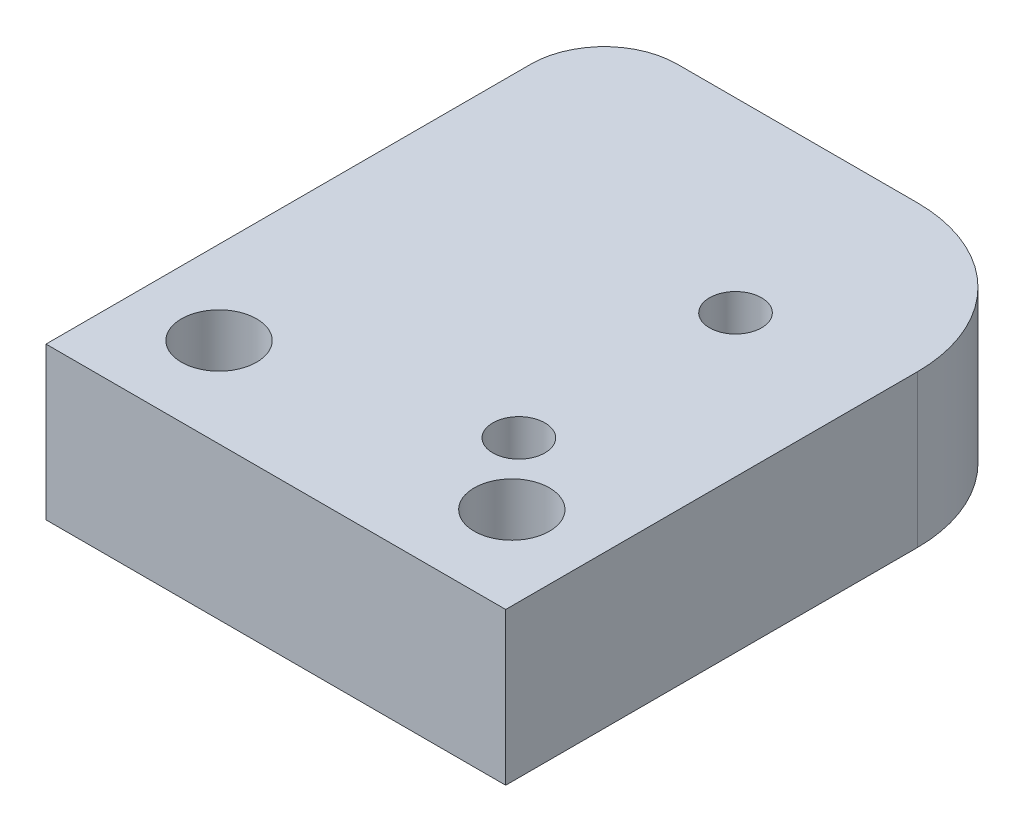
ISO-10303-21;
HEADER;
FILE_DESCRIPTION(('STEP AP214'),'2;1');
FILE_NAME('part.step','',(''),(''),'','','');
FILE_SCHEMA(('AUTOMOTIVE_DESIGN { 1 0 10303 214 1 1 1 1 }'));
ENDSEC;
DATA;
#1=APPLICATION_CONTEXT('core data for automotive mechanical design processes');
#2=APPLICATION_PROTOCOL_DEFINITION('international standard','automotive_design',2000,#1);
#3=PRODUCT_CONTEXT('',#1,'mechanical');
#4=PRODUCT('Part','Part','',(#3));
#5=PRODUCT_RELATED_PRODUCT_CATEGORY('part','',(#4));
#6=PRODUCT_DEFINITION_FORMATION('','',#4);
#7=PRODUCT_DEFINITION_CONTEXT('part definition',#1,'design');
#8=PRODUCT_DEFINITION('design','',#6,#7);
#9=PRODUCT_DEFINITION_SHAPE('','',#8);
#10=(LENGTH_UNIT() NAMED_UNIT(*) SI_UNIT(.MILLI.,.METRE.));
#11=(NAMED_UNIT(*) PLANE_ANGLE_UNIT() SI_UNIT($,.RADIAN.));
#12=(NAMED_UNIT(*) SI_UNIT($,.STERADIAN.) SOLID_ANGLE_UNIT());
#13=UNCERTAINTY_MEASURE_WITH_UNIT(LENGTH_MEASURE(1.E-05),#10,'distance_accuracy_value','');
#14=(GEOMETRIC_REPRESENTATION_CONTEXT(3) GLOBAL_UNCERTAINTY_ASSIGNED_CONTEXT((#13)) GLOBAL_UNIT_ASSIGNED_CONTEXT((#10,
#11,#12)) REPRESENTATION_CONTEXT('',''));
#15=CARTESIAN_POINT('',(0.,0.,0.));
#16=DIRECTION('',(0.,0.,1.));
#17=DIRECTION('',(1.,0.,0.));
#18=AXIS2_PLACEMENT_3D('',#15,#16,#17);
#19=CARTESIAN_POINT('',(-9.9695,6.604,-24.2062));
#20=DIRECTION('',(1.,0.,0.));
#21=DIRECTION('',(0.,0.,-1.));
#22=AXIS2_PLACEMENT_3D('',#19,#20,#21);
#23=PLANE('',#22);
#24=DIRECTION('',(0.,0.,1.));
#25=VECTOR('',#24,1.);
#26=CARTESIAN_POINT('',(-9.9695,6.604,-24.2062));
#27=LINE('',#26,#25);
#28=CARTESIAN_POINT('',(-9.9695,6.604,-21.0312));
#29=VERTEX_POINT('',#28);
#30=CARTESIAN_POINT('',(-9.96950000000001,6.604,0.));
#31=VERTEX_POINT('',#30);
#32=EDGE_CURVE('E87',#29,#31,#27,.T.);
#33=ORIENTED_EDGE('',*,*,#32,.F.);
#34=DIRECTION('',(0.,-1.,0.));
#35=VECTOR('',#34,1.);
#36=CARTESIAN_POINT('',(-9.9695,6.604,-21.0312));
#37=LINE('',#36,#35);
#38=CARTESIAN_POINT('',(-9.9695,0.,-21.0312));
#39=VERTEX_POINT('',#38);
#40=EDGE_CURVE('E125',#29,#39,#37,.T.);
#41=ORIENTED_EDGE('',*,*,#40,.T.);
#42=DIRECTION('',(0.,0.,1.));
#43=VECTOR('',#42,1.);
#44=CARTESIAN_POINT('',(-9.9695,0.,-24.2062));
#45=LINE('',#44,#43);
#46=CARTESIAN_POINT('',(-9.96950000000001,0.,0.));
#47=VERTEX_POINT('',#46);
#48=EDGE_CURVE('E109',#39,#47,#45,.T.);
#49=ORIENTED_EDGE('',*,*,#48,.T.);
#50=DIRECTION('',(0.,-1.,0.));
#51=VECTOR('',#50,1.);
#52=CARTESIAN_POINT('',(-9.96950000000001,6.604,0.));
#53=LINE('',#52,#51);
#54=EDGE_CURVE('E103',#31,#47,#53,.T.);
#55=ORIENTED_EDGE('',*,*,#54,.F.);
#56=EDGE_LOOP('',(#33,#41,#49,#55));
#57=FACE_BOUND('',#56,.T.);
#58=ADVANCED_FACE('F35',(#57),#23,.F.);
#59=CARTESIAN_POINT('',(-9.96950000000001,6.604,0.));
#60=DIRECTION('',(0.,0.,-1.));
#61=DIRECTION('',(-1.,0.,0.));
#62=AXIS2_PLACEMENT_3D('',#59,#60,#61);
#63=PLANE('',#62);
#64=DIRECTION('',(1.,0.,0.));
#65=VECTOR('',#64,1.);
#66=CARTESIAN_POINT('',(-9.96950000000001,0.,0.));
#67=LINE('',#66,#65);
#68=CARTESIAN_POINT('',(9.96950000000001,0.,0.));
#69=VERTEX_POINT('',#68);
#70=EDGE_CURVE('E130',#47,#69,#67,.T.);
#71=ORIENTED_EDGE('',*,*,#70,.T.);
#72=DIRECTION('',(0.,-1.,0.));
#73=VECTOR('',#72,1.);
#74=CARTESIAN_POINT('',(9.96950000000001,6.604,0.));
#75=LINE('',#74,#73);
#76=CARTESIAN_POINT('',(9.96950000000001,6.604,0.));
#77=VERTEX_POINT('',#76);
#78=EDGE_CURVE('E105',#77,#69,#75,.T.);
#79=ORIENTED_EDGE('',*,*,#78,.F.);
#80=DIRECTION('',(1.,0.,0.));
#81=VECTOR('',#80,1.);
#82=CARTESIAN_POINT('',(-9.96950000000001,6.604,0.));
#83=LINE('',#82,#81);
#84=EDGE_CURVE('E91',#31,#77,#83,.T.);
#85=ORIENTED_EDGE('',*,*,#84,.F.);
#86=ORIENTED_EDGE('',*,*,#54,.T.);
#87=EDGE_LOOP('',(#71,#79,#85,#86));
#88=FACE_BOUND('',#87,.T.);
#89=ADVANCED_FACE('F102',(#88),#63,.F.);
#90=CARTESIAN_POINT('',(9.9695,6.604,-24.2062));
#91=DIRECTION('',(-1.,0.,0.));
#92=DIRECTION('',(0.,0.,1.));
#93=AXIS2_PLACEMENT_3D('',#90,#91,#92);
#94=PLANE('',#93);
#95=DIRECTION('',(0.,0.,-1.));
#96=VECTOR('',#95,1.);
#97=CARTESIAN_POINT('',(9.9695,0.,-24.2062));
#98=LINE('',#97,#96);
#99=CARTESIAN_POINT('',(9.9695,0.,-17.8562));
#100=VERTEX_POINT('',#99);
#101=EDGE_CURVE('E133',#69,#100,#98,.T.);
#102=ORIENTED_EDGE('',*,*,#101,.T.);
#103=DIRECTION('',(0.,-1.,0.));
#104=VECTOR('',#103,1.);
#105=CARTESIAN_POINT('',(9.9695,6.604,-17.8562));
#106=LINE('',#105,#104);
#107=CARTESIAN_POINT('',(9.9695,6.604,-17.8562));
#108=VERTEX_POINT('',#107);
#109=EDGE_CURVE('E121',#100,#108,#106,.F.);
#110=ORIENTED_EDGE('',*,*,#109,.T.);
#111=DIRECTION('',(0.,0.,-1.));
#112=VECTOR('',#111,1.);
#113=CARTESIAN_POINT('',(9.9695,6.604,-24.2062));
#114=LINE('',#113,#112);
#115=EDGE_CURVE('E107',#77,#108,#114,.T.);
#116=ORIENTED_EDGE('',*,*,#115,.F.);
#117=ORIENTED_EDGE('',*,*,#78,.T.);
#118=EDGE_LOOP('',(#102,#110,#116,#117));
#119=FACE_BOUND('',#118,.T.);
#120=ADVANCED_FACE('F156',(#119),#94,.F.);
#121=CARTESIAN_POINT('',(-9.9695,6.604,-24.2062));
#122=DIRECTION('',(0.,0.,1.));
#123=DIRECTION('',(1.,0.,0.));
#124=AXIS2_PLACEMENT_3D('',#121,#122,#123);
#125=PLANE('',#124);
#126=DIRECTION('',(-1.,0.,0.));
#127=VECTOR('',#126,1.);
#128=CARTESIAN_POINT('',(-9.9695,0.,-24.2062));
#129=LINE('',#128,#127);
#130=CARTESIAN_POINT('',(3.61950000000001,0.,-24.2062));
#131=VERTEX_POINT('',#130);
#132=CARTESIAN_POINT('',(-6.7945,0.,-24.2062));
#133=VERTEX_POINT('',#132);
#134=EDGE_CURVE('E98',#131,#133,#129,.T.);
#135=ORIENTED_EDGE('',*,*,#134,.T.);
#136=DIRECTION('',(0.,-1.,0.));
#137=VECTOR('',#136,1.);
#138=CARTESIAN_POINT('',(-6.7945,6.604,-24.2062));
#139=LINE('',#138,#137);
#140=CARTESIAN_POINT('',(-6.7945,6.604,-24.2062));
#141=VERTEX_POINT('',#140);
#142=EDGE_CURVE('E43',#133,#141,#139,.F.);
#143=ORIENTED_EDGE('',*,*,#142,.T.);
#144=DIRECTION('',(-1.,0.,0.));
#145=VECTOR('',#144,1.);
#146=CARTESIAN_POINT('',(-9.9695,6.604,-24.2062));
#147=LINE('',#146,#145);
#148=CARTESIAN_POINT('',(3.61950000000001,6.604,-24.2062));
#149=VERTEX_POINT('',#148);
#150=EDGE_CURVE('E116',#149,#141,#147,.T.);
#151=ORIENTED_EDGE('',*,*,#150,.F.);
#152=DIRECTION('',(0.,-1.,0.));
#153=VECTOR('',#152,1.);
#154=CARTESIAN_POINT('',(3.61950000000001,6.604,-24.2062));
#155=LINE('',#154,#153);
#156=EDGE_CURVE('E111',#149,#131,#155,.T.);
#157=ORIENTED_EDGE('',*,*,#156,.T.);
#158=EDGE_LOOP('',(#135,#143,#151,#157));
#159=FACE_BOUND('',#158,.T.);
#160=ADVANCED_FACE('F142',(#159),#125,.F.);
#161=CARTESIAN_POINT('',(0.,6.604,0.));
#162=DIRECTION('',(0.,1.,0.));
#163=DIRECTION('',(0.,0.,1.));
#164=AXIS2_PLACEMENT_3D('',#161,#162,#163);
#165=PLANE('',#164);
#166=CARTESIAN_POINT('',(-6.35,6.604,-3.8862));
#167=DIRECTION('',(0.,-1.,0.));
#168=DIRECTION('',(0.,0.,-1.));
#169=AXIS2_PLACEMENT_3D('',#166,#167,#168);
#170=CIRCLE('',#169,1.63195);
#171=CARTESIAN_POINT('',(-6.35,6.604,-5.51815));
#172=VERTEX_POINT('',#171);
#173=EDGE_CURVE('E215',#172,#172,#170,.T.);
#174=ORIENTED_EDGE('',*,*,#173,.T.);
#175=EDGE_LOOP('',(#174));
#176=FACE_BOUND('',#175,.T.);
#177=CARTESIAN_POINT('',(6.35,6.604,-3.8862));
#178=DIRECTION('',(0.,-1.,0.));
#179=DIRECTION('',(0.,0.,-1.));
#180=AXIS2_PLACEMENT_3D('',#177,#178,#179);
#181=CIRCLE('',#180,1.63195);
#182=CARTESIAN_POINT('',(6.35,6.604,-5.51815));
#183=VERTEX_POINT('',#182);
#184=EDGE_CURVE('E227',#183,#183,#181,.T.);
#185=ORIENTED_EDGE('',*,*,#184,.T.);
#186=EDGE_LOOP('',(#185));
#187=FACE_BOUND('',#186,.T.);
#188=CARTESIAN_POINT('',(3.81,6.604,-16.129));
#189=DIRECTION('',(0.,1.,0.));
#190=DIRECTION('',(0.,0.,1.));
#191=AXIS2_PLACEMENT_3D('',#188,#189,#190);
#192=CIRCLE('',#191,1.13029999999999);
#193=CARTESIAN_POINT('',(3.81,6.604,-14.9987));
#194=VERTEX_POINT('',#193);
#195=EDGE_CURVE('E230',#194,#194,#192,.T.);
#196=ORIENTED_EDGE('',*,*,#195,.F.);
#197=EDGE_LOOP('',(#196));
#198=FACE_BOUND('',#197,.T.);
#199=CARTESIAN_POINT('',(3.81,6.604,-6.731));
#200=DIRECTION('',(0.,1.,0.));
#201=DIRECTION('',(0.,0.,1.));
#202=AXIS2_PLACEMENT_3D('',#199,#200,#201);
#203=CIRCLE('',#202,1.13029999999999);
#204=CARTESIAN_POINT('',(3.81,6.604,-5.60070000000001));
#205=VERTEX_POINT('',#204);
#206=EDGE_CURVE('E136',#205,#205,#203,.T.);
#207=ORIENTED_EDGE('',*,*,#206,.F.);
#208=EDGE_LOOP('',(#207));
#209=FACE_BOUND('',#208,.T.);
#210=ORIENTED_EDGE('',*,*,#150,.T.);
#211=CARTESIAN_POINT('',(-6.7945,6.604,-21.0312));
#212=DIRECTION('',(0.,1.,0.));
#213=DIRECTION('',(0.,0.,1.));
#214=AXIS2_PLACEMENT_3D('',#211,#212,#213);
#215=CIRCLE('',#214,3.175);
#216=EDGE_CURVE('E11',#141,#29,#215,.T.);
#217=ORIENTED_EDGE('',*,*,#216,.T.);
#218=ORIENTED_EDGE('',*,*,#32,.T.);
#219=ORIENTED_EDGE('',*,*,#84,.T.);
#220=ORIENTED_EDGE('',*,*,#115,.T.);
#221=CARTESIAN_POINT('',(3.6195,6.604,-17.8562));
#222=DIRECTION('',(0.,1.,0.));
#223=DIRECTION('',(0.,0.,1.));
#224=AXIS2_PLACEMENT_3D('',#221,#222,#223);
#225=CIRCLE('',#224,6.35);
#226=EDGE_CURVE('E123',#108,#149,#225,.T.);
#227=ORIENTED_EDGE('',*,*,#226,.T.);
#228=EDGE_LOOP('',(#210,#217,#218,#219,#220,#227));
#229=FACE_BOUND('',#228,.T.);
#230=ADVANCED_FACE('F89',(#176,#187,#198,#209,#229),#165,.T.);
#231=CARTESIAN_POINT('',(0.,0.,0.));
#232=DIRECTION('',(0.,1.,0.));
#233=DIRECTION('',(0.,0.,1.));
#234=AXIS2_PLACEMENT_3D('',#231,#232,#233);
#235=PLANE('',#234);
#236=CARTESIAN_POINT('',(-6.35,0.,-3.8862));
#237=DIRECTION('',(0.,-1.,0.));
#238=DIRECTION('',(0.,0.,-1.));
#239=AXIS2_PLACEMENT_3D('',#236,#237,#238);
#240=CIRCLE('',#239,2.45109999999999);
#241=CARTESIAN_POINT('',(-6.35,0.,-6.33729999999999));
#242=VERTEX_POINT('',#241);
#243=EDGE_CURVE('E208',#242,#242,#240,.T.);
#244=ORIENTED_EDGE('',*,*,#243,.F.);
#245=EDGE_LOOP('',(#244));
#246=FACE_BOUND('',#245,.T.);
#247=CARTESIAN_POINT('',(6.35,0.,-3.8862));
#248=DIRECTION('',(0.,-1.,0.));
#249=DIRECTION('',(0.,0.,-1.));
#250=AXIS2_PLACEMENT_3D('',#247,#248,#249);
#251=CIRCLE('',#250,2.45109999999999);
#252=CARTESIAN_POINT('',(6.35,0.,-6.33729999999999));
#253=VERTEX_POINT('',#252);
#254=EDGE_CURVE('E218',#253,#253,#251,.T.);
#255=ORIENTED_EDGE('',*,*,#254,.F.);
#256=EDGE_LOOP('',(#255));
#257=FACE_BOUND('',#256,.T.);
#258=CARTESIAN_POINT('',(3.81,0.,-16.129));
#259=DIRECTION('',(0.,1.,0.));
#260=DIRECTION('',(0.,0.,1.));
#261=AXIS2_PLACEMENT_3D('',#258,#259,#260);
#262=CIRCLE('',#261,1.13029999999999);
#263=CARTESIAN_POINT('',(3.81,0.,-14.9987));
#264=VERTEX_POINT('',#263);
#265=EDGE_CURVE('E233',#264,#264,#262,.T.);
#266=ORIENTED_EDGE('',*,*,#265,.T.);
#267=EDGE_LOOP('',(#266));
#268=FACE_BOUND('',#267,.T.);
#269=CARTESIAN_POINT('',(3.81,0.,-6.731));
#270=DIRECTION('',(0.,1.,0.));
#271=DIRECTION('',(0.,0.,1.));
#272=AXIS2_PLACEMENT_3D('',#269,#270,#271);
#273=CIRCLE('',#272,1.13029999999999);
#274=CARTESIAN_POINT('',(3.81,0.,-5.60070000000001));
#275=VERTEX_POINT('',#274);
#276=EDGE_CURVE('E131',#275,#275,#273,.T.);
#277=ORIENTED_EDGE('',*,*,#276,.T.);
#278=EDGE_LOOP('',(#277));
#279=FACE_BOUND('',#278,.T.);
#280=ORIENTED_EDGE('',*,*,#48,.F.);
#281=CARTESIAN_POINT('',(-6.7945,0.,-21.0312));
#282=DIRECTION('',(0.,1.,0.));
#283=DIRECTION('',(0.,0.,1.));
#284=AXIS2_PLACEMENT_3D('',#281,#282,#283);
#285=CIRCLE('',#284,3.175);
#286=EDGE_CURVE('E57',#39,#133,#285,.F.);
#287=ORIENTED_EDGE('',*,*,#286,.T.);
#288=ORIENTED_EDGE('',*,*,#134,.F.);
#289=CARTESIAN_POINT('',(3.6195,0.,-17.8562));
#290=DIRECTION('',(0.,1.,0.));
#291=DIRECTION('',(0.,0.,1.));
#292=AXIS2_PLACEMENT_3D('',#289,#290,#291);
#293=CIRCLE('',#292,6.35);
#294=EDGE_CURVE('E114',#131,#100,#293,.F.);
#295=ORIENTED_EDGE('',*,*,#294,.T.);
#296=ORIENTED_EDGE('',*,*,#101,.F.);
#297=ORIENTED_EDGE('',*,*,#70,.F.);
#298=EDGE_LOOP('',(#280,#287,#288,#295,#296,#297));
#299=FACE_BOUND('',#298,.T.);
#300=ADVANCED_FACE('F128',(#246,#257,#268,#279,#299),#235,.F.);
#301=CARTESIAN_POINT('',(3.81,6.604,-6.731));
#302=DIRECTION('',(0.,1.,0.));
#303=DIRECTION('',(0.,0.,1.));
#304=AXIS2_PLACEMENT_3D('',#301,#302,#303);
#305=CYLINDRICAL_SURFACE('',#304,1.13029999999999);
#306=ORIENTED_EDGE('',*,*,#276,.F.);
#307=EDGE_LOOP('',(#306));
#308=FACE_BOUND('',#307,.T.);
#309=ORIENTED_EDGE('',*,*,#206,.T.);
#310=EDGE_LOOP('',(#309));
#311=FACE_BOUND('',#310,.T.);
#312=ADVANCED_FACE('F166',(#308,#311),#305,.F.);
#313=CARTESIAN_POINT('',(3.81,6.604,-16.129));
#314=DIRECTION('',(0.,1.,0.));
#315=DIRECTION('',(0.,0.,1.));
#316=AXIS2_PLACEMENT_3D('',#313,#314,#315);
#317=CYLINDRICAL_SURFACE('',#316,1.13029999999999);
#318=ORIENTED_EDGE('',*,*,#265,.F.);
#319=EDGE_LOOP('',(#318));
#320=FACE_BOUND('',#319,.T.);
#321=ORIENTED_EDGE('',*,*,#195,.T.);
#322=EDGE_LOOP('',(#321));
#323=FACE_BOUND('',#322,.T.);
#324=ADVANCED_FACE('F173',(#320,#323),#317,.F.);
#325=CARTESIAN_POINT('',(6.35,0.,-3.8862));
#326=DIRECTION('',(0.,-1.,0.));
#327=DIRECTION('',(0.,0.,-1.));
#328=AXIS2_PLACEMENT_3D('',#325,#326,#327);
#329=CYLINDRICAL_SURFACE('',#328,1.63195000000001);
#330=ORIENTED_EDGE('',*,*,#184,.F.);
#331=EDGE_LOOP('',(#330));
#332=FACE_BOUND('',#331,.T.);
#333=CARTESIAN_POINT('',(6.35,1.7272,-3.8862));
#334=DIRECTION('',(0.,-1.,0.));
#335=DIRECTION('',(0.,0.,-1.));
#336=AXIS2_PLACEMENT_3D('',#333,#334,#335);
#337=CIRCLE('',#336,1.63195000000001);
#338=CARTESIAN_POINT('',(6.35,1.7272,-5.51815000000001));
#339=VERTEX_POINT('',#338);
#340=EDGE_CURVE('E224',#339,#339,#337,.T.);
#341=ORIENTED_EDGE('',*,*,#340,.T.);
#342=EDGE_LOOP('',(#341));
#343=FACE_BOUND('',#342,.T.);
#344=ADVANCED_FACE('F177',(#332,#343),#329,.F.);
#345=CARTESIAN_POINT('',(7.98195000000001,1.7272,-3.8862));
#346=DIRECTION('',(0.,1.,0.));
#347=DIRECTION('',(0.,0.,1.));
#348=AXIS2_PLACEMENT_3D('',#345,#346,#347);
#349=PLANE('',#348);
#350=ORIENTED_EDGE('',*,*,#340,.F.);
#351=EDGE_LOOP('',(#350));
#352=FACE_BOUND('',#351,.T.);
#353=CARTESIAN_POINT('',(6.35,1.7272,-3.8862));
#354=DIRECTION('',(0.,-1.,0.));
#355=DIRECTION('',(0.,0.,-1.));
#356=AXIS2_PLACEMENT_3D('',#353,#354,#355);
#357=CIRCLE('',#356,2.45109999999999);
#358=CARTESIAN_POINT('',(6.35,1.7272,-6.33729999999999));
#359=VERTEX_POINT('',#358);
#360=EDGE_CURVE('E221',#359,#359,#357,.T.);
#361=ORIENTED_EDGE('',*,*,#360,.T.);
#362=EDGE_LOOP('',(#361));
#363=FACE_BOUND('',#362,.T.);
#364=ADVANCED_FACE('F181',(#352,#363),#349,.F.);
#365=CARTESIAN_POINT('',(6.35,0.,-3.8862));
#366=DIRECTION('',(0.,-1.,0.));
#367=DIRECTION('',(0.,0.,-1.));
#368=AXIS2_PLACEMENT_3D('',#365,#366,#367);
#369=CYLINDRICAL_SURFACE('',#368,2.45109999999999);
#370=ORIENTED_EDGE('',*,*,#360,.F.);
#371=EDGE_LOOP('',(#370));
#372=FACE_BOUND('',#371,.T.);
#373=ORIENTED_EDGE('',*,*,#254,.T.);
#374=EDGE_LOOP('',(#373));
#375=FACE_BOUND('',#374,.T.);
#376=ADVANCED_FACE('F185',(#372,#375),#369,.F.);
#377=CARTESIAN_POINT('',(-6.35,0.,-3.8862));
#378=DIRECTION('',(0.,-1.,0.));
#379=DIRECTION('',(0.,0.,-1.));
#380=AXIS2_PLACEMENT_3D('',#377,#378,#379);
#381=CYLINDRICAL_SURFACE('',#380,1.63195000000001);
#382=ORIENTED_EDGE('',*,*,#173,.F.);
#383=EDGE_LOOP('',(#382));
#384=FACE_BOUND('',#383,.T.);
#385=CARTESIAN_POINT('',(-6.35,1.7272,-3.8862));
#386=DIRECTION('',(0.,-1.,0.));
#387=DIRECTION('',(0.,0.,-1.));
#388=AXIS2_PLACEMENT_3D('',#385,#386,#387);
#389=CIRCLE('',#388,1.63195000000001);
#390=CARTESIAN_POINT('',(-6.35,1.7272,-5.51815000000001));
#391=VERTEX_POINT('',#390);
#392=EDGE_CURVE('E210',#391,#391,#389,.T.);
#393=ORIENTED_EDGE('',*,*,#392,.T.);
#394=EDGE_LOOP('',(#393));
#395=FACE_BOUND('',#394,.T.);
#396=ADVANCED_FACE('F189',(#384,#395),#381,.F.);
#397=CARTESIAN_POINT('',(-4.71804999999999,1.7272,-3.8862));
#398=DIRECTION('',(0.,1.,0.));
#399=DIRECTION('',(0.,0.,1.));
#400=AXIS2_PLACEMENT_3D('',#397,#398,#399);
#401=PLANE('',#400);
#402=ORIENTED_EDGE('',*,*,#392,.F.);
#403=EDGE_LOOP('',(#402));
#404=FACE_BOUND('',#403,.T.);
#405=CARTESIAN_POINT('',(-6.35,1.7272,-3.8862));
#406=DIRECTION('',(0.,-1.,0.));
#407=DIRECTION('',(0.,0.,-1.));
#408=AXIS2_PLACEMENT_3D('',#405,#406,#407);
#409=CIRCLE('',#408,2.45109999999999);
#410=CARTESIAN_POINT('',(-6.35,1.7272,-6.33729999999999));
#411=VERTEX_POINT('',#410);
#412=EDGE_CURVE('E205',#411,#411,#409,.T.);
#413=ORIENTED_EDGE('',*,*,#412,.T.);
#414=EDGE_LOOP('',(#413));
#415=FACE_BOUND('',#414,.T.);
#416=ADVANCED_FACE('F193',(#404,#415),#401,.F.);
#417=CARTESIAN_POINT('',(-6.35,0.,-3.8862));
#418=DIRECTION('',(0.,-1.,0.));
#419=DIRECTION('',(0.,0.,-1.));
#420=AXIS2_PLACEMENT_3D('',#417,#418,#419);
#421=CYLINDRICAL_SURFACE('',#420,2.45109999999999);
#422=ORIENTED_EDGE('',*,*,#412,.F.);
#423=EDGE_LOOP('',(#422));
#424=FACE_BOUND('',#423,.T.);
#425=ORIENTED_EDGE('',*,*,#243,.T.);
#426=EDGE_LOOP('',(#425));
#427=FACE_BOUND('',#426,.T.);
#428=ADVANCED_FACE('F149',(#424,#427),#421,.F.);
#429=CARTESIAN_POINT('',(3.6195,6.604,-17.8562));
#430=DIRECTION('',(0.,-1.,0.));
#431=DIRECTION('',(0.,0.,-1.));
#432=AXIS2_PLACEMENT_3D('',#429,#430,#431);
#433=CYLINDRICAL_SURFACE('',#432,6.35);
#434=ORIENTED_EDGE('',*,*,#226,.F.);
#435=ORIENTED_EDGE('',*,*,#109,.F.);
#436=ORIENTED_EDGE('',*,*,#294,.F.);
#437=ORIENTED_EDGE('',*,*,#156,.F.);
#438=EDGE_LOOP('',(#434,#435,#436,#437));
#439=FACE_BOUND('',#438,.T.);
#440=ADVANCED_FACE('F145',(#439),#433,.T.);
#441=CARTESIAN_POINT('',(-6.7945,6.604,-21.0312));
#442=DIRECTION('',(0.,-1.,0.));
#443=DIRECTION('',(0.,0.,-1.));
#444=AXIS2_PLACEMENT_3D('',#441,#442,#443);
#445=CYLINDRICAL_SURFACE('',#444,3.175);
#446=ORIENTED_EDGE('',*,*,#216,.F.);
#447=ORIENTED_EDGE('',*,*,#142,.F.);
#448=ORIENTED_EDGE('',*,*,#286,.F.);
#449=ORIENTED_EDGE('',*,*,#40,.F.);
#450=EDGE_LOOP('',(#446,#447,#448,#449));
#451=FACE_BOUND('',#450,.T.);
#452=ADVANCED_FACE('F37',(#451),#445,.T.);
#453=CLOSED_SHELL('',(#58,#89,#120,#160,#230,#300,#312,#324,#344,#364,#376,#396,#416,#428,#440,#452));
#454=MANIFOLD_SOLID_BREP('B2',#453);
#455=ADVANCED_BREP_SHAPE_REPRESENTATION('',(#18,#454),#14);
#456=SHAPE_DEFINITION_REPRESENTATION(#9,#455);
ENDSEC;
END-ISO-10303-21;
